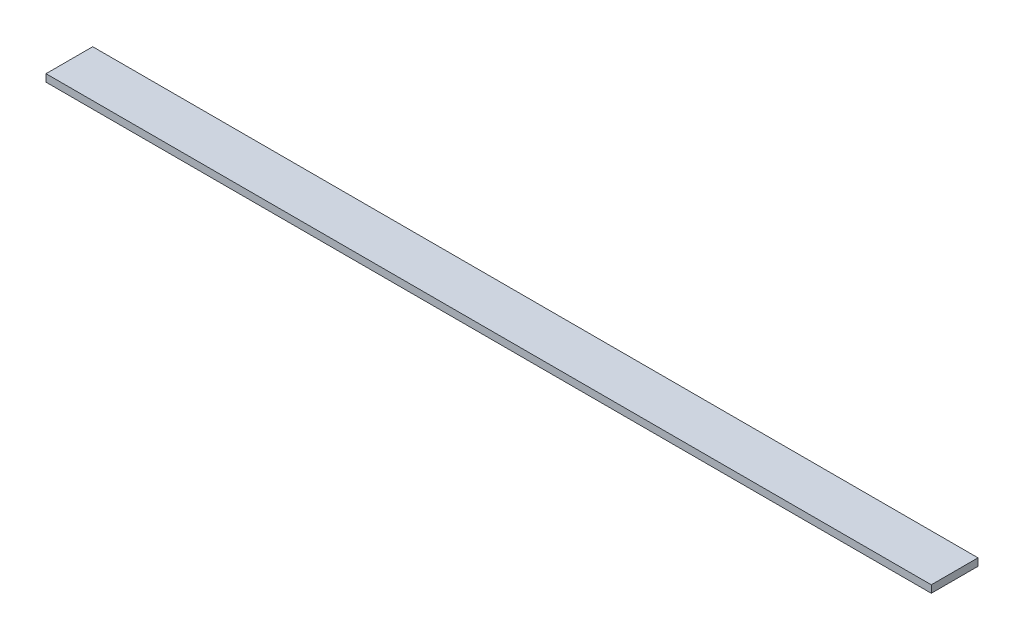
ISO-10303-21;
HEADER;
FILE_DESCRIPTION(('STEP AP214'),'2;1');
FILE_NAME('part.step','',(''),(''),'','','');
FILE_SCHEMA(('AUTOMOTIVE_DESIGN { 1 0 10303 214 1 1 1 1 }'));
ENDSEC;
DATA;
#1=APPLICATION_CONTEXT('core data for automotive mechanical design processes');
#2=APPLICATION_PROTOCOL_DEFINITION('international standard','automotive_design',2000,#1);
#3=PRODUCT_CONTEXT('',#1,'mechanical');
#4=PRODUCT('Part','Part','',(#3));
#5=PRODUCT_RELATED_PRODUCT_CATEGORY('part','',(#4));
#6=PRODUCT_DEFINITION_FORMATION('','',#4);
#7=PRODUCT_DEFINITION_CONTEXT('part definition',#1,'design');
#8=PRODUCT_DEFINITION('design','',#6,#7);
#9=PRODUCT_DEFINITION_SHAPE('','',#8);
#10=(LENGTH_UNIT() NAMED_UNIT(*) SI_UNIT(.MILLI.,.METRE.));
#11=(NAMED_UNIT(*) PLANE_ANGLE_UNIT() SI_UNIT($,.RADIAN.));
#12=(NAMED_UNIT(*) SI_UNIT($,.STERADIAN.) SOLID_ANGLE_UNIT());
#13=UNCERTAINTY_MEASURE_WITH_UNIT(LENGTH_MEASURE(1.E-05),#10,'distance_accuracy_value','');
#14=(GEOMETRIC_REPRESENTATION_CONTEXT(3) GLOBAL_UNCERTAINTY_ASSIGNED_CONTEXT((#13)) GLOBAL_UNIT_ASSIGNED_CONTEXT((#10,
#11,#12)) REPRESENTATION_CONTEXT('',''));
#15=CARTESIAN_POINT('',(0.,0.,0.));
#16=DIRECTION('',(0.,0.,1.));
#17=DIRECTION('',(1.,0.,0.));
#18=AXIS2_PLACEMENT_3D('',#15,#16,#17);
#19=CARTESIAN_POINT('',(900.000000000002,15.,-47.5));
#20=DIRECTION('',(-1.,0.,0.));
#21=DIRECTION('',(0.,0.,1.));
#22=AXIS2_PLACEMENT_3D('',#19,#20,#21);
#23=PLANE('',#22);
#24=DIRECTION('',(0.,0.,-1.));
#25=VECTOR('',#24,1.);
#26=CARTESIAN_POINT('',(900.000000000002,0.,-47.5));
#27=LINE('',#26,#25);
#28=CARTESIAN_POINT('',(900.000000000002,0.,47.5));
#29=VERTEX_POINT('',#28);
#30=CARTESIAN_POINT('',(900.000000000002,0.,-47.5));
#31=VERTEX_POINT('',#30);
#32=EDGE_CURVE('E96',#29,#31,#27,.T.);
#33=ORIENTED_EDGE('',*,*,#32,.T.);
#34=DIRECTION('',(0.,-1.,0.));
#35=VECTOR('',#34,1.);
#36=CARTESIAN_POINT('',(900.000000000002,15.,-47.5));
#37=LINE('',#36,#35);
#38=CARTESIAN_POINT('',(900.000000000002,15.,-47.5));
#39=VERTEX_POINT('',#38);
#40=EDGE_CURVE('E11',#39,#31,#37,.T.);
#41=ORIENTED_EDGE('',*,*,#40,.F.);
#42=DIRECTION('',(0.,0.,-1.));
#43=VECTOR('',#42,1.);
#44=CARTESIAN_POINT('',(900.000000000002,15.,-47.5));
#45=LINE('',#44,#43);
#46=CARTESIAN_POINT('',(900.000000000002,15.,47.5));
#47=VERTEX_POINT('',#46);
#48=EDGE_CURVE('E84',#47,#39,#45,.T.);
#49=ORIENTED_EDGE('',*,*,#48,.F.);
#50=DIRECTION('',(0.,-1.,0.));
#51=VECTOR('',#50,1.);
#52=CARTESIAN_POINT('',(900.000000000002,15.,47.5));
#53=LINE('',#52,#51);
#54=EDGE_CURVE('E92',#47,#29,#53,.T.);
#55=ORIENTED_EDGE('',*,*,#54,.T.);
#56=EDGE_LOOP('',(#33,#41,#49,#55));
#57=FACE_BOUND('',#56,.T.);
#58=ADVANCED_FACE('F33',(#57),#23,.F.);
#59=CARTESIAN_POINT('',(-899.999999999999,15.,-47.5));
#60=DIRECTION('',(0.,0.,1.));
#61=DIRECTION('',(1.,0.,0.));
#62=AXIS2_PLACEMENT_3D('',#59,#60,#61);
#63=PLANE('',#62);
#64=DIRECTION('',(-1.,0.,0.));
#65=VECTOR('',#64,1.);
#66=CARTESIAN_POINT('',(-899.999999999999,0.,-47.5));
#67=LINE('',#66,#65);
#68=CARTESIAN_POINT('',(-899.999999999999,0.,-47.5));
#69=VERTEX_POINT('',#68);
#70=EDGE_CURVE('E88',#31,#69,#67,.T.);
#71=ORIENTED_EDGE('',*,*,#70,.T.);
#72=DIRECTION('',(0.,-1.,0.));
#73=VECTOR('',#72,1.);
#74=CARTESIAN_POINT('',(-899.999999999999,15.,-47.5));
#75=LINE('',#74,#73);
#76=CARTESIAN_POINT('',(-899.999999999999,15.,-47.5));
#77=VERTEX_POINT('',#76);
#78=EDGE_CURVE('E41',#77,#69,#75,.T.);
#79=ORIENTED_EDGE('',*,*,#78,.F.);
#80=DIRECTION('',(-1.,0.,0.));
#81=VECTOR('',#80,1.);
#82=CARTESIAN_POINT('',(-899.999999999999,15.,-47.5));
#83=LINE('',#82,#81);
#84=EDGE_CURVE('E79',#39,#77,#83,.T.);
#85=ORIENTED_EDGE('',*,*,#84,.F.);
#86=ORIENTED_EDGE('',*,*,#40,.T.);
#87=EDGE_LOOP('',(#71,#79,#85,#86));
#88=FACE_BOUND('',#87,.T.);
#89=ADVANCED_FACE('F87',(#88),#63,.F.);
#90=CARTESIAN_POINT('',(-899.999999999999,15.,-47.5));
#91=DIRECTION('',(1.,0.,0.));
#92=DIRECTION('',(0.,0.,-1.));
#93=AXIS2_PLACEMENT_3D('',#90,#91,#92);
#94=PLANE('',#93);
#95=DIRECTION('',(0.,0.,1.));
#96=VECTOR('',#95,1.);
#97=CARTESIAN_POINT('',(-899.999999999999,0.,-47.5));
#98=LINE('',#97,#96);
#99=CARTESIAN_POINT('',(-899.999999999999,0.,47.5));
#100=VERTEX_POINT('',#99);
#101=EDGE_CURVE('E66',#69,#100,#98,.T.);
#102=ORIENTED_EDGE('',*,*,#101,.T.);
#103=DIRECTION('',(0.,-1.,0.));
#104=VECTOR('',#103,1.);
#105=CARTESIAN_POINT('',(-899.999999999999,15.,47.5));
#106=LINE('',#105,#104);
#107=CARTESIAN_POINT('',(-899.999999999999,15.,47.5));
#108=VERTEX_POINT('',#107);
#109=EDGE_CURVE('E89',#108,#100,#106,.T.);
#110=ORIENTED_EDGE('',*,*,#109,.F.);
#111=DIRECTION('',(0.,0.,1.));
#112=VECTOR('',#111,1.);
#113=CARTESIAN_POINT('',(-899.999999999999,15.,-47.5));
#114=LINE('',#113,#112);
#115=EDGE_CURVE('E82',#77,#108,#114,.T.);
#116=ORIENTED_EDGE('',*,*,#115,.F.);
#117=ORIENTED_EDGE('',*,*,#78,.T.);
#118=EDGE_LOOP('',(#102,#110,#116,#117));
#119=FACE_BOUND('',#118,.T.);
#120=ADVANCED_FACE('F90',(#119),#94,.F.);
#121=CARTESIAN_POINT('',(-899.999999999999,15.,47.5));
#122=DIRECTION('',(0.,0.,-1.));
#123=DIRECTION('',(-1.,0.,0.));
#124=AXIS2_PLACEMENT_3D('',#121,#122,#123);
#125=PLANE('',#124);
#126=DIRECTION('',(1.,0.,0.));
#127=VECTOR('',#126,1.);
#128=CARTESIAN_POINT('',(-899.999999999999,0.,47.5));
#129=LINE('',#128,#127);
#130=EDGE_CURVE('E72',#100,#29,#129,.T.);
#131=ORIENTED_EDGE('',*,*,#130,.T.);
#132=ORIENTED_EDGE('',*,*,#54,.F.);
#133=DIRECTION('',(1.,0.,0.));
#134=VECTOR('',#133,1.);
#135=CARTESIAN_POINT('',(-899.999999999999,15.,47.5));
#136=LINE('',#135,#134);
#137=EDGE_CURVE('E49',#108,#47,#136,.T.);
#138=ORIENTED_EDGE('',*,*,#137,.F.);
#139=ORIENTED_EDGE('',*,*,#109,.T.);
#140=EDGE_LOOP('',(#131,#132,#138,#139));
#141=FACE_BOUND('',#140,.T.);
#142=ADVANCED_FACE('F103',(#141),#125,.F.);
#143=CARTESIAN_POINT('',(0.,15.,0.));
#144=DIRECTION('',(0.,1.,0.));
#145=DIRECTION('',(0.,0.,1.));
#146=AXIS2_PLACEMENT_3D('',#143,#144,#145);
#147=PLANE('',#146);
#148=ORIENTED_EDGE('',*,*,#48,.T.);
#149=ORIENTED_EDGE('',*,*,#84,.T.);
#150=ORIENTED_EDGE('',*,*,#115,.T.);
#151=ORIENTED_EDGE('',*,*,#137,.T.);
#152=EDGE_LOOP('',(#148,#149,#150,#151));
#153=FACE_BOUND('',#152,.T.);
#154=ADVANCED_FACE('F80',(#153),#147,.T.);
#155=CARTESIAN_POINT('',(0.,0.,0.));
#156=DIRECTION('',(0.,1.,0.));
#157=DIRECTION('',(0.,0.,1.));
#158=AXIS2_PLACEMENT_3D('',#155,#156,#157);
#159=PLANE('',#158);
#160=ORIENTED_EDGE('',*,*,#32,.F.);
#161=ORIENTED_EDGE('',*,*,#130,.F.);
#162=ORIENTED_EDGE('',*,*,#101,.F.);
#163=ORIENTED_EDGE('',*,*,#70,.F.);
#164=EDGE_LOOP('',(#160,#161,#162,#163));
#165=FACE_BOUND('',#164,.T.);
#166=ADVANCED_FACE('F106',(#165),#159,.F.);
#167=CLOSED_SHELL('',(#58,#89,#120,#142,#154,#166));
#168=MANIFOLD_SOLID_BREP('B2',#167);
#169=ADVANCED_BREP_SHAPE_REPRESENTATION('',(#18,#168),#14);
#170=SHAPE_DEFINITION_REPRESENTATION(#9,#169);
ENDSEC;
END-ISO-10303-21;
